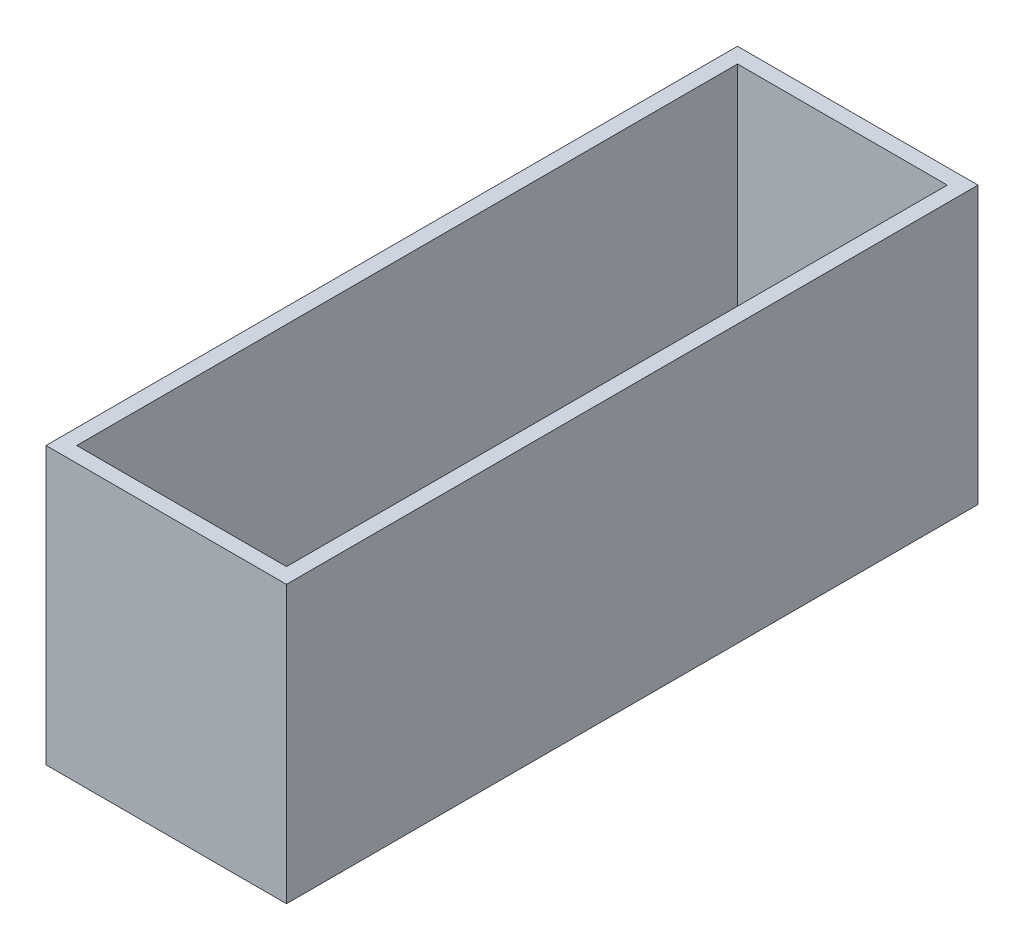
ISO-10303-21;
HEADER;
FILE_DESCRIPTION(('STEP AP214'),'2;1');
FILE_NAME('part.step','',(''),(''),'','','');
FILE_SCHEMA(('AUTOMOTIVE_DESIGN { 1 0 10303 214 1 1 1 1 }'));
ENDSEC;
DATA;
#1=APPLICATION_CONTEXT('core data for automotive mechanical design processes');
#2=APPLICATION_PROTOCOL_DEFINITION('international standard','automotive_design',2000,#1);
#3=PRODUCT_CONTEXT('',#1,'mechanical');
#4=PRODUCT('Part','Part','',(#3));
#5=PRODUCT_RELATED_PRODUCT_CATEGORY('part','',(#4));
#6=PRODUCT_DEFINITION_FORMATION('','',#4);
#7=PRODUCT_DEFINITION_CONTEXT('part definition',#1,'design');
#8=PRODUCT_DEFINITION('design','',#6,#7);
#9=PRODUCT_DEFINITION_SHAPE('','',#8);
#10=(LENGTH_UNIT() NAMED_UNIT(*) SI_UNIT(.MILLI.,.METRE.));
#11=(NAMED_UNIT(*) PLANE_ANGLE_UNIT() SI_UNIT($,.RADIAN.));
#12=(NAMED_UNIT(*) SI_UNIT($,.STERADIAN.) SOLID_ANGLE_UNIT());
#13=UNCERTAINTY_MEASURE_WITH_UNIT(LENGTH_MEASURE(1.E-05),#10,'distance_accuracy_value','');
#14=(GEOMETRIC_REPRESENTATION_CONTEXT(3) GLOBAL_UNCERTAINTY_ASSIGNED_CONTEXT((#13)) GLOBAL_UNIT_ASSIGNED_CONTEXT((#10,
#11,#12)) REPRESENTATION_CONTEXT('',''));
#15=CARTESIAN_POINT('',(0.,0.,0.));
#16=DIRECTION('',(0.,0.,1.));
#17=DIRECTION('',(1.,0.,0.));
#18=AXIS2_PLACEMENT_3D('',#15,#16,#17);
#19=CARTESIAN_POINT('',(-78.25,-90.,450.));
#20=DIRECTION('',(1.,0.,0.));
#21=DIRECTION('',(0.,0.,-1.));
#22=AXIS2_PLACEMENT_3D('',#19,#20,#21);
#23=PLANE('',#22);
#24=DIRECTION('',(0.,-1.,0.));
#25=VECTOR('',#24,1.);
#26=CARTESIAN_POINT('',(-78.25,-90.,0.));
#27=LINE('',#26,#25);
#28=CARTESIAN_POINT('',(-78.25,90.,0.));
#29=VERTEX_POINT('',#28);
#30=CARTESIAN_POINT('',(-78.25,-90.,0.));
#31=VERTEX_POINT('',#30);
#32=EDGE_CURVE('E141',#29,#31,#27,.T.);
#33=ORIENTED_EDGE('',*,*,#32,.T.);
#34=DIRECTION('',(0.,0.,-1.));
#35=VECTOR('',#34,1.);
#36=CARTESIAN_POINT('',(-78.25,-90.,450.));
#37=LINE('',#36,#35);
#38=CARTESIAN_POINT('',(-78.25,-90.,450.));
#39=VERTEX_POINT('',#38);
#40=EDGE_CURVE('E11',#39,#31,#37,.T.);
#41=ORIENTED_EDGE('',*,*,#40,.F.);
#42=DIRECTION('',(0.,-1.,0.));
#43=VECTOR('',#42,1.);
#44=CARTESIAN_POINT('',(-78.25,-90.,450.));
#45=LINE('',#44,#43);
#46=CARTESIAN_POINT('',(-78.25,90.,450.));
#47=VERTEX_POINT('',#46);
#48=EDGE_CURVE('E145',#47,#39,#45,.T.);
#49=ORIENTED_EDGE('',*,*,#48,.F.);
#50=DIRECTION('',(0.,0.,-1.));
#51=VECTOR('',#50,1.);
#52=CARTESIAN_POINT('',(-78.25,90.,450.));
#53=LINE('',#52,#51);
#54=EDGE_CURVE('E151',#47,#29,#53,.T.);
#55=ORIENTED_EDGE('',*,*,#54,.T.);
#56=EDGE_LOOP('',(#33,#41,#49,#55));
#57=FACE_BOUND('',#56,.T.);
#58=ADVANCED_FACE('F33',(#57),#23,.F.);
#59=CARTESIAN_POINT('',(78.25,-89.9999999999999,450.));
#60=DIRECTION('',(0.,1.,0.));
#61=DIRECTION('',(-1.,0.,0.));
#62=AXIS2_PLACEMENT_3D('',#59,#60,#61);
#63=PLANE('',#62);
#64=DIRECTION('',(1.,0.,0.));
#65=VECTOR('',#64,1.);
#66=CARTESIAN_POINT('',(78.25,-89.9999999999999,0.));
#67=LINE('',#66,#65);
#68=CARTESIAN_POINT('',(78.25,-89.9999999999999,0.));
#69=VERTEX_POINT('',#68);
#70=EDGE_CURVE('E154',#31,#69,#67,.T.);
#71=ORIENTED_EDGE('',*,*,#70,.T.);
#72=DIRECTION('',(0.,0.,-1.));
#73=VECTOR('',#72,1.);
#74=CARTESIAN_POINT('',(78.25,-89.9999999999999,450.));
#75=LINE('',#74,#73);
#76=CARTESIAN_POINT('',(78.25,-89.9999999999999,450.));
#77=VERTEX_POINT('',#76);
#78=EDGE_CURVE('E40',#77,#69,#75,.T.);
#79=ORIENTED_EDGE('',*,*,#78,.F.);
#80=DIRECTION('',(1.,0.,0.));
#81=VECTOR('',#80,1.);
#82=CARTESIAN_POINT('',(78.25,-89.9999999999999,450.));
#83=LINE('',#82,#81);
#84=EDGE_CURVE('E84',#39,#77,#83,.T.);
#85=ORIENTED_EDGE('',*,*,#84,.F.);
#86=ORIENTED_EDGE('',*,*,#40,.T.);
#87=EDGE_LOOP('',(#71,#79,#85,#86));
#88=FACE_BOUND('',#87,.T.);
#89=ADVANCED_FACE('F183',(#88),#63,.F.);
#90=CARTESIAN_POINT('',(78.25,-89.9999999999999,450.));
#91=DIRECTION('',(-1.,0.,0.));
#92=DIRECTION('',(0.,0.,1.));
#93=AXIS2_PLACEMENT_3D('',#90,#91,#92);
#94=PLANE('',#93);
#95=DIRECTION('',(0.,1.,0.));
#96=VECTOR('',#95,1.);
#97=CARTESIAN_POINT('',(78.25,-89.9999999999999,0.));
#98=LINE('',#97,#96);
#99=CARTESIAN_POINT('',(78.25,90.0000000000001,0.));
#100=VERTEX_POINT('',#99);
#101=EDGE_CURVE('E156',#69,#100,#98,.T.);
#102=ORIENTED_EDGE('',*,*,#101,.T.);
#103=DIRECTION('',(0.,0.,-1.));
#104=VECTOR('',#103,1.);
#105=CARTESIAN_POINT('',(78.25,90.0000000000001,450.));
#106=LINE('',#105,#104);
#107=CARTESIAN_POINT('',(78.25,90.0000000000001,450.));
#108=VERTEX_POINT('',#107);
#109=EDGE_CURVE('E160',#108,#100,#106,.T.);
#110=ORIENTED_EDGE('',*,*,#109,.F.);
#111=DIRECTION('',(0.,1.,0.));
#112=VECTOR('',#111,1.);
#113=CARTESIAN_POINT('',(78.25,-89.9999999999999,450.));
#114=LINE('',#113,#112);
#115=EDGE_CURVE('E148',#77,#108,#114,.T.);
#116=ORIENTED_EDGE('',*,*,#115,.F.);
#117=ORIENTED_EDGE('',*,*,#78,.T.);
#118=EDGE_LOOP('',(#102,#110,#116,#117));
#119=FACE_BOUND('',#118,.T.);
#120=ADVANCED_FACE('F165',(#119),#94,.F.);
#121=CARTESIAN_POINT('',(78.25,90.0000000000001,450.));
#122=DIRECTION('',(0.,-1.,0.));
#123=DIRECTION('',(1.,0.,0.));
#124=AXIS2_PLACEMENT_3D('',#121,#122,#123);
#125=PLANE('',#124);
#126=DIRECTION('',(-1.,0.,0.));
#127=VECTOR('',#126,1.);
#128=CARTESIAN_POINT('',(68.25,90.0000000000001,10.));
#129=LINE('',#128,#127);
#130=CARTESIAN_POINT('',(68.25,90.0000000000001,10.));
#131=VERTEX_POINT('',#130);
#132=CARTESIAN_POINT('',(-68.25,90.,10.));
#133=VERTEX_POINT('',#132);
#134=EDGE_CURVE('E135',#131,#133,#129,.T.);
#135=ORIENTED_EDGE('',*,*,#134,.F.);
#136=DIRECTION('',(0.,0.,-1.));
#137=VECTOR('',#136,1.);
#138=CARTESIAN_POINT('',(68.25,90.0000000000001,440.));
#139=LINE('',#138,#137);
#140=CARTESIAN_POINT('',(68.25,90.0000000000001,440.));
#141=VERTEX_POINT('',#140);
#142=EDGE_CURVE('E47',#141,#131,#139,.T.);
#143=ORIENTED_EDGE('',*,*,#142,.F.);
#144=DIRECTION('',(1.,0.,0.));
#145=VECTOR('',#144,1.);
#146=CARTESIAN_POINT('',(-68.25,90.,440.));
#147=LINE('',#146,#145);
#148=CARTESIAN_POINT('',(-68.25,90.,440.));
#149=VERTEX_POINT('',#148);
#150=EDGE_CURVE('E126',#149,#141,#147,.T.);
#151=ORIENTED_EDGE('',*,*,#150,.F.);
#152=DIRECTION('',(0.,0.,1.));
#153=VECTOR('',#152,1.);
#154=CARTESIAN_POINT('',(-68.25,90.,10.));
#155=LINE('',#154,#153);
#156=EDGE_CURVE('E129',#133,#149,#155,.T.);
#157=ORIENTED_EDGE('',*,*,#156,.F.);
#158=EDGE_LOOP('',(#135,#143,#151,#157));
#159=FACE_BOUND('',#158,.T.);
#160=DIRECTION('',(-1.,0.,0.));
#161=VECTOR('',#160,1.);
#162=CARTESIAN_POINT('',(78.25,90.0000000000001,0.));
#163=LINE('',#162,#161);
#164=EDGE_CURVE('E77',#100,#29,#163,.T.);
#165=ORIENTED_EDGE('',*,*,#164,.T.);
#166=ORIENTED_EDGE('',*,*,#54,.F.);
#167=DIRECTION('',(-1.,0.,0.));
#168=VECTOR('',#167,1.);
#169=CARTESIAN_POINT('',(78.25,90.0000000000001,450.));
#170=LINE('',#169,#168);
#171=EDGE_CURVE('E56',#108,#47,#170,.T.);
#172=ORIENTED_EDGE('',*,*,#171,.F.);
#173=ORIENTED_EDGE('',*,*,#109,.T.);
#174=EDGE_LOOP('',(#165,#166,#172,#173));
#175=FACE_BOUND('',#174,.T.);
#176=ADVANCED_FACE('F173',(#159,#175),#125,.F.);
#177=CARTESIAN_POINT('',(0.,0.,450.));
#178=DIRECTION('',(0.,0.,1.));
#179=DIRECTION('',(1.,0.,0.));
#180=AXIS2_PLACEMENT_3D('',#177,#178,#179);
#181=PLANE('',#180);
#182=ORIENTED_EDGE('',*,*,#48,.T.);
#183=ORIENTED_EDGE('',*,*,#84,.T.);
#184=ORIENTED_EDGE('',*,*,#115,.T.);
#185=ORIENTED_EDGE('',*,*,#171,.T.);
#186=EDGE_LOOP('',(#182,#183,#184,#185));
#187=FACE_BOUND('',#186,.T.);
#188=ADVANCED_FACE('F175',(#187),#181,.T.);
#189=CARTESIAN_POINT('',(0.,0.,0.));
#190=DIRECTION('',(0.,0.,1.));
#191=DIRECTION('',(1.,0.,0.));
#192=AXIS2_PLACEMENT_3D('',#189,#190,#191);
#193=PLANE('',#192);
#194=ORIENTED_EDGE('',*,*,#32,.F.);
#195=ORIENTED_EDGE('',*,*,#164,.F.);
#196=ORIENTED_EDGE('',*,*,#101,.F.);
#197=ORIENTED_EDGE('',*,*,#70,.F.);
#198=EDGE_LOOP('',(#194,#195,#196,#197));
#199=FACE_BOUND('',#198,.T.);
#200=ADVANCED_FACE('F169',(#199),#193,.F.);
#201=CARTESIAN_POINT('',(68.25,-70.,440.));
#202=DIRECTION('',(1.,0.,0.));
#203=DIRECTION('',(0.,1.,0.));
#204=AXIS2_PLACEMENT_3D('',#201,#202,#203);
#205=PLANE('',#204);
#206=ORIENTED_EDGE('',*,*,#142,.T.);
#207=DIRECTION('',(0.,1.,0.));
#208=VECTOR('',#207,1.);
#209=CARTESIAN_POINT('',(68.25,-70.,10.));
#210=LINE('',#209,#208);
#211=CARTESIAN_POINT('',(68.25,-70.,10.));
#212=VERTEX_POINT('',#211);
#213=EDGE_CURVE('E104',#212,#131,#210,.T.);
#214=ORIENTED_EDGE('',*,*,#213,.F.);
#215=DIRECTION('',(0.,0.,-1.));
#216=VECTOR('',#215,1.);
#217=CARTESIAN_POINT('',(68.25,-70.,440.));
#218=LINE('',#217,#216);
#219=CARTESIAN_POINT('',(68.25,-70.,440.));
#220=VERTEX_POINT('',#219);
#221=EDGE_CURVE('E108',#220,#212,#218,.T.);
#222=ORIENTED_EDGE('',*,*,#221,.F.);
#223=DIRECTION('',(0.,1.,0.));
#224=VECTOR('',#223,1.);
#225=CARTESIAN_POINT('',(68.25,-70.,440.));
#226=LINE('',#225,#224);
#227=EDGE_CURVE('E139',#220,#141,#226,.T.);
#228=ORIENTED_EDGE('',*,*,#227,.T.);
#229=EDGE_LOOP('',(#206,#214,#222,#228));
#230=FACE_BOUND('',#229,.T.);
#231=ADVANCED_FACE('F106',(#230),#205,.F.);
#232=CARTESIAN_POINT('',(-68.25,-70.,440.));
#233=DIRECTION('',(0.,0.,1.));
#234=DIRECTION('',(1.,0.,0.));
#235=AXIS2_PLACEMENT_3D('',#232,#233,#234);
#236=PLANE('',#235);
#237=ORIENTED_EDGE('',*,*,#150,.T.);
#238=ORIENTED_EDGE('',*,*,#227,.F.);
#239=DIRECTION('',(1.,0.,0.));
#240=VECTOR('',#239,1.);
#241=CARTESIAN_POINT('',(-68.25,-70.,440.));
#242=LINE('',#241,#240);
#243=CARTESIAN_POINT('',(-68.25,-70.,440.));
#244=VERTEX_POINT('',#243);
#245=EDGE_CURVE('E114',#244,#220,#242,.T.);
#246=ORIENTED_EDGE('',*,*,#245,.F.);
#247=DIRECTION('',(0.,1.,0.));
#248=VECTOR('',#247,1.);
#249=CARTESIAN_POINT('',(-68.25,-70.,440.));
#250=LINE('',#249,#248);
#251=EDGE_CURVE('E142',#244,#149,#250,.T.);
#252=ORIENTED_EDGE('',*,*,#251,.T.);
#253=EDGE_LOOP('',(#237,#238,#246,#252));
#254=FACE_BOUND('',#253,.T.);
#255=ADVANCED_FACE('F222',(#254),#236,.F.);
#256=CARTESIAN_POINT('',(-68.25,-70.,10.));
#257=DIRECTION('',(-1.,0.,0.));
#258=DIRECTION('',(0.,-1.,0.));
#259=AXIS2_PLACEMENT_3D('',#256,#257,#258);
#260=PLANE('',#259);
#261=ORIENTED_EDGE('',*,*,#156,.T.);
#262=ORIENTED_EDGE('',*,*,#251,.F.);
#263=DIRECTION('',(0.,0.,1.));
#264=VECTOR('',#263,1.);
#265=CARTESIAN_POINT('',(-68.25,-70.,10.));
#266=LINE('',#265,#264);
#267=CARTESIAN_POINT('',(-68.25,-70.,10.));
#268=VERTEX_POINT('',#267);
#269=EDGE_CURVE('E122',#268,#244,#266,.T.);
#270=ORIENTED_EDGE('',*,*,#269,.F.);
#271=DIRECTION('',(0.,1.,0.));
#272=VECTOR('',#271,1.);
#273=CARTESIAN_POINT('',(-68.25,-70.,10.));
#274=LINE('',#273,#272);
#275=EDGE_CURVE('E113',#268,#133,#274,.T.);
#276=ORIENTED_EDGE('',*,*,#275,.T.);
#277=EDGE_LOOP('',(#261,#262,#270,#276));
#278=FACE_BOUND('',#277,.T.);
#279=ADVANCED_FACE('F231',(#278),#260,.F.);
#280=CARTESIAN_POINT('',(68.25,-70.,10.));
#281=DIRECTION('',(0.,0.,-1.));
#282=DIRECTION('',(-1.,0.,0.));
#283=AXIS2_PLACEMENT_3D('',#280,#281,#282);
#284=PLANE('',#283);
#285=ORIENTED_EDGE('',*,*,#134,.T.);
#286=ORIENTED_EDGE('',*,*,#275,.F.);
#287=DIRECTION('',(-1.,0.,0.));
#288=VECTOR('',#287,1.);
#289=CARTESIAN_POINT('',(68.25,-70.,10.));
#290=LINE('',#289,#288);
#291=EDGE_CURVE('E117',#212,#268,#290,.T.);
#292=ORIENTED_EDGE('',*,*,#291,.F.);
#293=ORIENTED_EDGE('',*,*,#213,.T.);
#294=EDGE_LOOP('',(#285,#286,#292,#293));
#295=FACE_BOUND('',#294,.T.);
#296=ADVANCED_FACE('F118',(#295),#284,.F.);
#297=CARTESIAN_POINT('',(0.,-70.,0.));
#298=DIRECTION('',(0.,1.,0.));
#299=DIRECTION('',(-1.,0.,0.));
#300=AXIS2_PLACEMENT_3D('',#297,#298,#299);
#301=PLANE('',#300);
#302=ORIENTED_EDGE('',*,*,#221,.T.);
#303=ORIENTED_EDGE('',*,*,#291,.T.);
#304=ORIENTED_EDGE('',*,*,#269,.T.);
#305=ORIENTED_EDGE('',*,*,#245,.T.);
#306=EDGE_LOOP('',(#302,#303,#304,#305));
#307=FACE_BOUND('',#306,.T.);
#308=ADVANCED_FACE('F124',(#307),#301,.T.);
#309=CLOSED_SHELL('',(#58,#89,#120,#176,#188,#200,#231,#255,#279,#296,#308));
#310=MANIFOLD_SOLID_BREP('B2',#309);
#311=ADVANCED_BREP_SHAPE_REPRESENTATION('',(#18,#310),#14);
#312=SHAPE_DEFINITION_REPRESENTATION(#9,#311);
ENDSEC;
END-ISO-10303-21;
